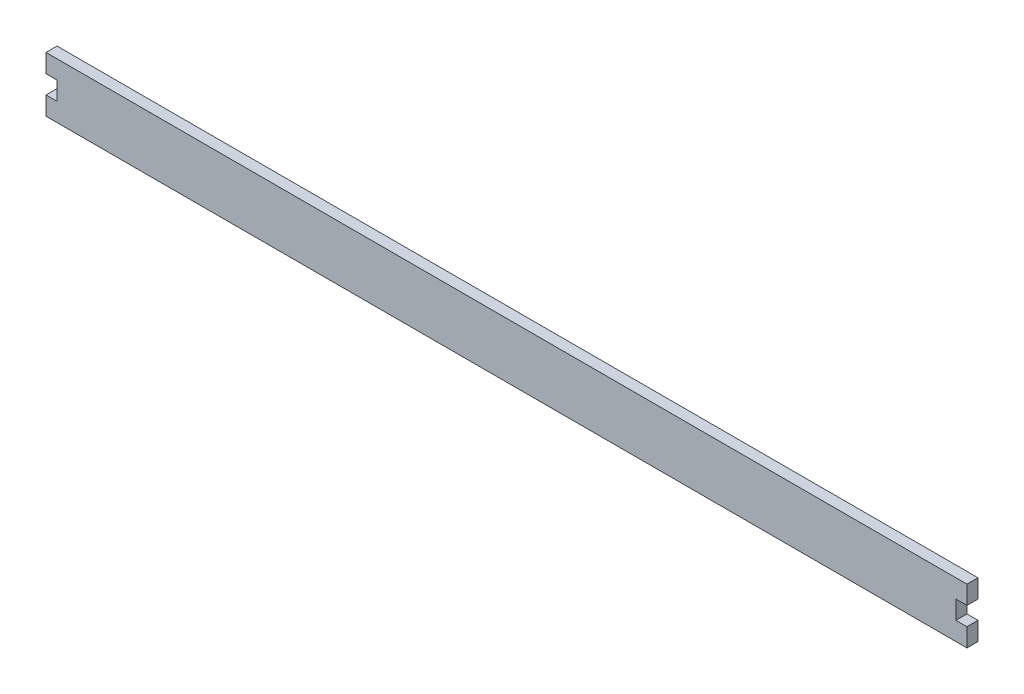
ISO-10303-21;
HEADER;
FILE_DESCRIPTION(('STEP AP214'),'2;1');
FILE_NAME('part.step','',(''),(''),'','','');
FILE_SCHEMA(('AUTOMOTIVE_DESIGN { 1 0 10303 214 1 1 1 1 }'));
ENDSEC;
DATA;
#1=APPLICATION_CONTEXT('core data for automotive mechanical design processes');
#2=APPLICATION_PROTOCOL_DEFINITION('international standard','automotive_design',2000,#1);
#3=PRODUCT_CONTEXT('',#1,'mechanical');
#4=PRODUCT('Part','Part','',(#3));
#5=PRODUCT_RELATED_PRODUCT_CATEGORY('part','',(#4));
#6=PRODUCT_DEFINITION_FORMATION('','',#4);
#7=PRODUCT_DEFINITION_CONTEXT('part definition',#1,'design');
#8=PRODUCT_DEFINITION('design','',#6,#7);
#9=PRODUCT_DEFINITION_SHAPE('','',#8);
#10=(LENGTH_UNIT() NAMED_UNIT(*) SI_UNIT(.MILLI.,.METRE.));
#11=(NAMED_UNIT(*) PLANE_ANGLE_UNIT() SI_UNIT($,.RADIAN.));
#12=(NAMED_UNIT(*) SI_UNIT($,.STERADIAN.) SOLID_ANGLE_UNIT());
#13=UNCERTAINTY_MEASURE_WITH_UNIT(LENGTH_MEASURE(1.E-05),#10,'distance_accuracy_value','');
#14=(GEOMETRIC_REPRESENTATION_CONTEXT(3) GLOBAL_UNCERTAINTY_ASSIGNED_CONTEXT((#13)) GLOBAL_UNIT_ASSIGNED_CONTEXT((#10,
#11,#12)) REPRESENTATION_CONTEXT('',''));
#15=CARTESIAN_POINT('',(0.,0.,0.));
#16=DIRECTION('',(0.,0.,1.));
#17=DIRECTION('',(1.,0.,0.));
#18=AXIS2_PLACEMENT_3D('',#15,#16,#17);
#19=CARTESIAN_POINT('',(-65.2047278841298,0.,6.));
#20=DIRECTION('',(1.,0.,0.));
#21=DIRECTION('',(0.,0.,-1.));
#22=AXIS2_PLACEMENT_3D('',#19,#20,#21);
#23=PLANE('',#22);
#24=DIRECTION('',(0.,-1.,0.));
#25=VECTOR('',#24,1.);
#26=CARTESIAN_POINT('',(-65.2047278841298,0.,0.));
#27=LINE('',#26,#25);
#28=CARTESIAN_POINT('',(-65.2047278841298,13.5511354420113,0.));
#29=VERTEX_POINT('',#28);
#30=CARTESIAN_POINT('',(-65.2047278841298,3.55113544201134,0.));
#31=VERTEX_POINT('',#30);
#32=EDGE_CURVE('E159',#29,#31,#27,.T.);
#33=ORIENTED_EDGE('',*,*,#32,.T.);
#34=DIRECTION('',(0.,0.,-1.));
#35=VECTOR('',#34,1.);
#36=CARTESIAN_POINT('',(-65.2047278841298,3.55113544201134,6.));
#37=LINE('',#36,#35);
#38=CARTESIAN_POINT('',(-65.2047278841298,3.55113544201134,6.));
#39=VERTEX_POINT('',#38);
#40=EDGE_CURVE('E11',#39,#31,#37,.T.);
#41=ORIENTED_EDGE('',*,*,#40,.F.);
#42=DIRECTION('',(0.,-1.,0.));
#43=VECTOR('',#42,1.);
#44=CARTESIAN_POINT('',(-65.2047278841298,0.,6.));
#45=LINE('',#44,#43);
#46=CARTESIAN_POINT('',(-65.2047278841298,13.5511354420113,6.));
#47=VERTEX_POINT('',#46);
#48=EDGE_CURVE('E183',#47,#39,#45,.T.);
#49=ORIENTED_EDGE('',*,*,#48,.F.);
#50=DIRECTION('',(0.,0.,-1.));
#51=VECTOR('',#50,1.);
#52=CARTESIAN_POINT('',(-65.2047278841298,13.5511354420113,6.));
#53=LINE('',#52,#51);
#54=EDGE_CURVE('E158',#47,#29,#53,.T.);
#55=ORIENTED_EDGE('',*,*,#54,.T.);
#56=EDGE_LOOP('',(#33,#41,#49,#55));
#57=FACE_BOUND('',#56,.T.);
#58=ADVANCED_FACE('F34',(#57),#23,.F.);
#59=CARTESIAN_POINT('',(0.,3.55113544201135,6.));
#60=DIRECTION('',(0.,-1.,0.));
#61=DIRECTION('',(1.,0.,0.));
#62=AXIS2_PLACEMENT_3D('',#59,#60,#61);
#63=PLANE('',#62);
#64=DIRECTION('',(-1.,0.,0.));
#65=VECTOR('',#64,1.);
#66=CARTESIAN_POINT('',(0.,3.55113544201135,0.));
#67=LINE('',#66,#65);
#68=CARTESIAN_POINT('',(-71.2047278841298,3.55113544201134,0.));
#69=VERTEX_POINT('',#68);
#70=EDGE_CURVE('E162',#31,#69,#67,.T.);
#71=ORIENTED_EDGE('',*,*,#70,.T.);
#72=DIRECTION('',(0.,0.,-1.));
#73=VECTOR('',#72,1.);
#74=CARTESIAN_POINT('',(-71.2047278841298,3.55113544201134,6.));
#75=LINE('',#74,#73);
#76=CARTESIAN_POINT('',(-71.2047278841298,3.55113544201134,6.));
#77=VERTEX_POINT('',#76);
#78=EDGE_CURVE('E42',#77,#69,#75,.T.);
#79=ORIENTED_EDGE('',*,*,#78,.F.);
#80=DIRECTION('',(-1.,0.,0.));
#81=VECTOR('',#80,1.);
#82=CARTESIAN_POINT('',(0.,3.55113544201135,6.));
#83=LINE('',#82,#81);
#84=EDGE_CURVE('E104',#39,#77,#83,.T.);
#85=ORIENTED_EDGE('',*,*,#84,.F.);
#86=ORIENTED_EDGE('',*,*,#40,.T.);
#87=EDGE_LOOP('',(#71,#79,#85,#86));
#88=FACE_BOUND('',#87,.T.);
#89=ADVANCED_FACE('F252',(#88),#63,.F.);
#90=CARTESIAN_POINT('',(-71.2047278841298,0.,6.));
#91=DIRECTION('',(1.,0.,0.));
#92=DIRECTION('',(0.,0.,-1.));
#93=AXIS2_PLACEMENT_3D('',#90,#91,#92);
#94=PLANE('',#93);
#95=DIRECTION('',(0.,-1.,0.));
#96=VECTOR('',#95,1.);
#97=CARTESIAN_POINT('',(-71.2047278841298,0.,0.));
#98=LINE('',#97,#96);
#99=CARTESIAN_POINT('',(-71.2047278841298,-6.44886455798865,0.));
#100=VERTEX_POINT('',#99);
#101=EDGE_CURVE('E164',#69,#100,#98,.T.);
#102=ORIENTED_EDGE('',*,*,#101,.T.);
#103=DIRECTION('',(0.,0.,-1.));
#104=VECTOR('',#103,1.);
#105=CARTESIAN_POINT('',(-71.2047278841298,-6.44886455798865,6.));
#106=LINE('',#105,#104);
#107=CARTESIAN_POINT('',(-71.2047278841298,-6.44886455798865,6.));
#108=VERTEX_POINT('',#107);
#109=EDGE_CURVE('E198',#108,#100,#106,.T.);
#110=ORIENTED_EDGE('',*,*,#109,.F.);
#111=DIRECTION('',(0.,-1.,0.));
#112=VECTOR('',#111,1.);
#113=CARTESIAN_POINT('',(-71.2047278841298,0.,6.));
#114=LINE('',#113,#112);
#115=EDGE_CURVE('E144',#77,#108,#114,.T.);
#116=ORIENTED_EDGE('',*,*,#115,.F.);
#117=ORIENTED_EDGE('',*,*,#78,.T.);
#118=EDGE_LOOP('',(#102,#110,#116,#117));
#119=FACE_BOUND('',#118,.T.);
#120=ADVANCED_FACE('F204',(#119),#94,.F.);
#121=CARTESIAN_POINT('',(0.,-6.44886455798865,6.));
#122=DIRECTION('',(0.,1.,0.));
#123=DIRECTION('',(0.,0.,1.));
#124=AXIS2_PLACEMENT_3D('',#121,#122,#123);
#125=PLANE('',#124);
#126=DIRECTION('',(1.,0.,0.));
#127=VECTOR('',#126,1.);
#128=CARTESIAN_POINT('',(0.,-6.44886455798865,0.));
#129=LINE('',#128,#127);
#130=CARTESIAN_POINT('',(428.79527211587,-6.44886455798865,0.));
#131=VERTEX_POINT('',#130);
#132=EDGE_CURVE('E166',#100,#131,#129,.T.);
#133=ORIENTED_EDGE('',*,*,#132,.T.);
#134=DIRECTION('',(0.,0.,-1.));
#135=VECTOR('',#134,1.);
#136=CARTESIAN_POINT('',(428.79527211587,-6.44886455798865,6.));
#137=LINE('',#136,#135);
#138=CARTESIAN_POINT('',(428.79527211587,-6.44886455798865,6.));
#139=VERTEX_POINT('',#138);
#140=EDGE_CURVE('E195',#139,#131,#137,.T.);
#141=ORIENTED_EDGE('',*,*,#140,.F.);
#142=DIRECTION('',(1.,0.,0.));
#143=VECTOR('',#142,1.);
#144=CARTESIAN_POINT('',(0.,-6.44886455798865,6.));
#145=LINE('',#144,#143);
#146=EDGE_CURVE('E222',#108,#139,#145,.T.);
#147=ORIENTED_EDGE('',*,*,#146,.F.);
#148=ORIENTED_EDGE('',*,*,#109,.T.);
#149=EDGE_LOOP('',(#133,#141,#147,#148));
#150=FACE_BOUND('',#149,.T.);
#151=ADVANCED_FACE('F213',(#150),#125,.F.);
#152=CARTESIAN_POINT('',(428.79527211587,0.,6.));
#153=DIRECTION('',(-1.,0.,0.));
#154=DIRECTION('',(0.,0.,1.));
#155=AXIS2_PLACEMENT_3D('',#152,#153,#154);
#156=PLANE('',#155);
#157=DIRECTION('',(0.,1.,0.));
#158=VECTOR('',#157,1.);
#159=CARTESIAN_POINT('',(428.79527211587,0.,0.));
#160=LINE('',#159,#158);
#161=CARTESIAN_POINT('',(428.79527211587,3.55113544201134,0.));
#162=VERTEX_POINT('',#161);
#163=EDGE_CURVE('E168',#131,#162,#160,.T.);
#164=ORIENTED_EDGE('',*,*,#163,.T.);
#165=DIRECTION('',(0.,0.,-1.));
#166=VECTOR('',#165,1.);
#167=CARTESIAN_POINT('',(428.79527211587,3.55113544201134,6.));
#168=LINE('',#167,#166);
#169=CARTESIAN_POINT('',(428.79527211587,3.55113544201134,6.));
#170=VERTEX_POINT('',#169);
#171=EDGE_CURVE('E193',#170,#162,#168,.T.);
#172=ORIENTED_EDGE('',*,*,#171,.F.);
#173=DIRECTION('',(0.,1.,0.));
#174=VECTOR('',#173,1.);
#175=CARTESIAN_POINT('',(428.79527211587,0.,6.));
#176=LINE('',#175,#174);
#177=EDGE_CURVE('E153',#139,#170,#176,.T.);
#178=ORIENTED_EDGE('',*,*,#177,.F.);
#179=ORIENTED_EDGE('',*,*,#140,.T.);
#180=EDGE_LOOP('',(#164,#172,#178,#179));
#181=FACE_BOUND('',#180,.T.);
#182=ADVANCED_FACE('F217',(#181),#156,.F.);
#183=CARTESIAN_POINT('',(0.,3.55113544201134,6.));
#184=DIRECTION('',(0.,1.,0.));
#185=DIRECTION('',(0.,0.,1.));
#186=AXIS2_PLACEMENT_3D('',#183,#184,#185);
#187=PLANE('',#186);
#188=DIRECTION('',(1.,0.,0.));
#189=VECTOR('',#188,1.);
#190=CARTESIAN_POINT('',(0.,3.55113544201134,0.));
#191=LINE('',#190,#189);
#192=CARTESIAN_POINT('',(422.79527211587,3.55113544201134,0.));
#193=VERTEX_POINT('',#192);
#194=EDGE_CURVE('E171',#193,#162,#191,.T.);
#195=ORIENTED_EDGE('',*,*,#194,.F.);
#196=DIRECTION('',(0.,0.,-1.));
#197=VECTOR('',#196,1.);
#198=CARTESIAN_POINT('',(422.79527211587,3.55113544201134,6.));
#199=LINE('',#198,#197);
#200=CARTESIAN_POINT('',(422.79527211587,3.55113544201134,6.));
#201=VERTEX_POINT('',#200);
#202=EDGE_CURVE('E191',#201,#193,#199,.T.);
#203=ORIENTED_EDGE('',*,*,#202,.F.);
#204=DIRECTION('',(1.,0.,0.));
#205=VECTOR('',#204,1.);
#206=CARTESIAN_POINT('',(0.,3.55113544201134,6.));
#207=LINE('',#206,#205);
#208=EDGE_CURVE('E221',#201,#170,#207,.T.);
#209=ORIENTED_EDGE('',*,*,#208,.T.);
#210=ORIENTED_EDGE('',*,*,#171,.T.);
#211=EDGE_LOOP('',(#195,#203,#209,#210));
#212=FACE_BOUND('',#211,.T.);
#213=ADVANCED_FACE('F236',(#212),#187,.T.);
#214=CARTESIAN_POINT('',(422.79527211587,0.,6.));
#215=DIRECTION('',(1.,0.,0.));
#216=DIRECTION('',(0.,0.,-1.));
#217=AXIS2_PLACEMENT_3D('',#214,#215,#216);
#218=PLANE('',#217);
#219=DIRECTION('',(0.,-1.,0.));
#220=VECTOR('',#219,1.);
#221=CARTESIAN_POINT('',(422.79527211587,0.,0.));
#222=LINE('',#221,#220);
#223=CARTESIAN_POINT('',(422.79527211587,13.5511354420113,0.));
#224=VERTEX_POINT('',#223);
#225=EDGE_CURVE('E175',#224,#193,#222,.T.);
#226=ORIENTED_EDGE('',*,*,#225,.F.);
#227=DIRECTION('',(0.,0.,-1.));
#228=VECTOR('',#227,1.);
#229=CARTESIAN_POINT('',(422.79527211587,13.5511354420113,6.));
#230=LINE('',#229,#228);
#231=CARTESIAN_POINT('',(422.79527211587,13.5511354420113,6.));
#232=VERTEX_POINT('',#231);
#233=EDGE_CURVE('E189',#232,#224,#230,.T.);
#234=ORIENTED_EDGE('',*,*,#233,.F.);
#235=DIRECTION('',(0.,-1.,0.));
#236=VECTOR('',#235,1.);
#237=CARTESIAN_POINT('',(422.79527211587,0.,6.));
#238=LINE('',#237,#236);
#239=EDGE_CURVE('E223',#232,#201,#238,.T.);
#240=ORIENTED_EDGE('',*,*,#239,.T.);
#241=ORIENTED_EDGE('',*,*,#202,.T.);
#242=EDGE_LOOP('',(#226,#234,#240,#241));
#243=FACE_BOUND('',#242,.T.);
#244=ADVANCED_FACE('F237',(#243),#218,.T.);
#245=CARTESIAN_POINT('',(0.,13.5511354420113,6.));
#246=DIRECTION('',(0.,-1.,0.));
#247=DIRECTION('',(0.,0.,-1.));
#248=AXIS2_PLACEMENT_3D('',#245,#246,#247);
#249=PLANE('',#248);
#250=DIRECTION('',(-1.,0.,0.));
#251=VECTOR('',#250,1.);
#252=CARTESIAN_POINT('',(0.,13.5511354420113,0.));
#253=LINE('',#252,#251);
#254=CARTESIAN_POINT('',(428.79527211587,13.5511354420113,0.));
#255=VERTEX_POINT('',#254);
#256=EDGE_CURVE('E178',#255,#224,#253,.T.);
#257=ORIENTED_EDGE('',*,*,#256,.F.);
#258=DIRECTION('',(0.,0.,-1.));
#259=VECTOR('',#258,1.);
#260=CARTESIAN_POINT('',(428.79527211587,13.5511354420113,6.));
#261=LINE('',#260,#259);
#262=CARTESIAN_POINT('',(428.79527211587,13.5511354420113,6.));
#263=VERTEX_POINT('',#262);
#264=EDGE_CURVE('E187',#263,#255,#261,.T.);
#265=ORIENTED_EDGE('',*,*,#264,.F.);
#266=DIRECTION('',(-1.,0.,0.));
#267=VECTOR('',#266,1.);
#268=CARTESIAN_POINT('',(0.,13.5511354420113,6.));
#269=LINE('',#268,#267);
#270=EDGE_CURVE('E151',#263,#232,#269,.T.);
#271=ORIENTED_EDGE('',*,*,#270,.T.);
#272=ORIENTED_EDGE('',*,*,#233,.T.);
#273=EDGE_LOOP('',(#257,#265,#271,#272));
#274=FACE_BOUND('',#273,.T.);
#275=ADVANCED_FACE('F232',(#274),#249,.T.);
#276=CARTESIAN_POINT('',(428.79527211587,23.5511354420113,0.));
#277=VERTEX_POINT('',#276);
#278=EDGE_CURVE('E172',#255,#277,#160,.T.);
#279=ORIENTED_EDGE('',*,*,#278,.T.);
#280=DIRECTION('',(0.,0.,-1.));
#281=VECTOR('',#280,1.);
#282=CARTESIAN_POINT('',(428.79527211587,23.5511354420113,6.));
#283=LINE('',#282,#281);
#284=CARTESIAN_POINT('',(428.79527211587,23.5511354420113,6.));
#285=VERTEX_POINT('',#284);
#286=EDGE_CURVE('E138',#285,#277,#283,.T.);
#287=ORIENTED_EDGE('',*,*,#286,.F.);
#288=EDGE_CURVE('E148',#263,#285,#176,.T.);
#289=ORIENTED_EDGE('',*,*,#288,.F.);
#290=ORIENTED_EDGE('',*,*,#264,.T.);
#291=EDGE_LOOP('',(#279,#287,#289,#290));
#292=FACE_BOUND('',#291,.T.);
#293=ADVANCED_FACE('F241',(#292),#156,.F.);
#294=CARTESIAN_POINT('',(0.,23.5511354420113,6.));
#295=DIRECTION('',(0.,1.,0.));
#296=DIRECTION('',(0.,0.,1.));
#297=AXIS2_PLACEMENT_3D('',#294,#295,#296);
#298=PLANE('',#297);
#299=DIRECTION('',(1.,0.,0.));
#300=VECTOR('',#299,1.);
#301=CARTESIAN_POINT('',(0.,23.5511354420113,0.));
#302=LINE('',#301,#300);
#303=CARTESIAN_POINT('',(-71.2047278841298,23.5511354420113,0.));
#304=VERTEX_POINT('',#303);
#305=EDGE_CURVE('E137',#304,#277,#302,.T.);
#306=ORIENTED_EDGE('',*,*,#305,.F.);
#307=DIRECTION('',(0.,0.,-1.));
#308=VECTOR('',#307,1.);
#309=CARTESIAN_POINT('',(-71.2047278841298,23.5511354420113,6.));
#310=LINE('',#309,#308);
#311=CARTESIAN_POINT('',(-71.2047278841298,23.5511354420113,6.));
#312=VERTEX_POINT('',#311);
#313=EDGE_CURVE('E131',#312,#304,#310,.T.);
#314=ORIENTED_EDGE('',*,*,#313,.F.);
#315=DIRECTION('',(1.,0.,0.));
#316=VECTOR('',#315,1.);
#317=CARTESIAN_POINT('',(0.,23.5511354420113,6.));
#318=LINE('',#317,#316);
#319=EDGE_CURVE('E135',#312,#285,#318,.T.);
#320=ORIENTED_EDGE('',*,*,#319,.T.);
#321=ORIENTED_EDGE('',*,*,#286,.T.);
#322=EDGE_LOOP('',(#306,#314,#320,#321));
#323=FACE_BOUND('',#322,.T.);
#324=ADVANCED_FACE('F133',(#323),#298,.T.);
#325=CARTESIAN_POINT('',(-71.2047278841298,13.5511354420113,0.));
#326=VERTEX_POINT('',#325);
#327=EDGE_CURVE('E90',#304,#326,#98,.T.);
#328=ORIENTED_EDGE('',*,*,#327,.T.);
#329=DIRECTION('',(0.,0.,-1.));
#330=VECTOR('',#329,1.);
#331=CARTESIAN_POINT('',(-71.2047278841298,13.5511354420113,6.));
#332=LINE('',#331,#330);
#333=CARTESIAN_POINT('',(-71.2047278841298,13.5511354420113,6.));
#334=VERTEX_POINT('',#333);
#335=EDGE_CURVE('E139',#334,#326,#332,.T.);
#336=ORIENTED_EDGE('',*,*,#335,.F.);
#337=EDGE_CURVE('E141',#312,#334,#114,.T.);
#338=ORIENTED_EDGE('',*,*,#337,.F.);
#339=ORIENTED_EDGE('',*,*,#313,.T.);
#340=EDGE_LOOP('',(#328,#336,#338,#339));
#341=FACE_BOUND('',#340,.T.);
#342=ADVANCED_FACE('F142',(#341),#94,.F.);
#343=CARTESIAN_POINT('',(0.,13.5511354420113,6.));
#344=DIRECTION('',(0.,1.,0.));
#345=DIRECTION('',(0.,0.,1.));
#346=AXIS2_PLACEMENT_3D('',#343,#344,#345);
#347=PLANE('',#346);
#348=DIRECTION('',(1.,0.,0.));
#349=VECTOR('',#348,1.);
#350=CARTESIAN_POINT('',(0.,13.5511354420113,0.));
#351=LINE('',#350,#349);
#352=EDGE_CURVE('E96',#326,#29,#351,.T.);
#353=ORIENTED_EDGE('',*,*,#352,.T.);
#354=ORIENTED_EDGE('',*,*,#54,.F.);
#355=DIRECTION('',(1.,0.,0.));
#356=VECTOR('',#355,1.);
#357=CARTESIAN_POINT('',(0.,13.5511354420113,6.));
#358=LINE('',#357,#356);
#359=EDGE_CURVE('E50',#334,#47,#358,.T.);
#360=ORIENTED_EDGE('',*,*,#359,.F.);
#361=ORIENTED_EDGE('',*,*,#335,.T.);
#362=EDGE_LOOP('',(#353,#354,#360,#361));
#363=FACE_BOUND('',#362,.T.);
#364=ADVANCED_FACE('F259',(#363),#347,.F.);
#365=CARTESIAN_POINT('',(0.,0.,6.));
#366=DIRECTION('',(0.,0.,1.));
#367=DIRECTION('',(1.,0.,0.));
#368=AXIS2_PLACEMENT_3D('',#365,#366,#367);
#369=PLANE('',#368);
#370=ORIENTED_EDGE('',*,*,#48,.T.);
#371=ORIENTED_EDGE('',*,*,#84,.T.);
#372=ORIENTED_EDGE('',*,*,#115,.T.);
#373=ORIENTED_EDGE('',*,*,#146,.T.);
#374=ORIENTED_EDGE('',*,*,#177,.T.);
#375=ORIENTED_EDGE('',*,*,#208,.F.);
#376=ORIENTED_EDGE('',*,*,#239,.F.);
#377=ORIENTED_EDGE('',*,*,#270,.F.);
#378=ORIENTED_EDGE('',*,*,#288,.T.);
#379=ORIENTED_EDGE('',*,*,#319,.F.);
#380=ORIENTED_EDGE('',*,*,#337,.T.);
#381=ORIENTED_EDGE('',*,*,#359,.T.);
#382=EDGE_LOOP('',(#370,#371,#372,#373,#374,#375,#376,#377,#378,#379,#380,#381));
#383=FACE_BOUND('',#382,.T.);
#384=ADVANCED_FACE('F145',(#383),#369,.T.);
#385=CARTESIAN_POINT('',(0.,0.,0.));
#386=DIRECTION('',(0.,0.,1.));
#387=DIRECTION('',(1.,0.,0.));
#388=AXIS2_PLACEMENT_3D('',#385,#386,#387);
#389=PLANE('',#388);
#390=ORIENTED_EDGE('',*,*,#32,.F.);
#391=ORIENTED_EDGE('',*,*,#352,.F.);
#392=ORIENTED_EDGE('',*,*,#327,.F.);
#393=ORIENTED_EDGE('',*,*,#305,.T.);
#394=ORIENTED_EDGE('',*,*,#278,.F.);
#395=ORIENTED_EDGE('',*,*,#256,.T.);
#396=ORIENTED_EDGE('',*,*,#225,.T.);
#397=ORIENTED_EDGE('',*,*,#194,.T.);
#398=ORIENTED_EDGE('',*,*,#163,.F.);
#399=ORIENTED_EDGE('',*,*,#132,.F.);
#400=ORIENTED_EDGE('',*,*,#101,.F.);
#401=ORIENTED_EDGE('',*,*,#70,.F.);
#402=EDGE_LOOP('',(#390,#391,#392,#393,#394,#395,#396,#397,#398,#399,#400,#401));
#403=FACE_BOUND('',#402,.T.);
#404=ADVANCED_FACE('F209',(#403),#389,.F.);
#405=CLOSED_SHELL('',(#58,#89,#120,#151,#182,#213,#244,#275,#293,#324,#342,#364,#384,#404));
#406=MANIFOLD_SOLID_BREP('B2',#405);
#407=ADVANCED_BREP_SHAPE_REPRESENTATION('',(#18,#406),#14);
#408=SHAPE_DEFINITION_REPRESENTATION(#9,#407);
ENDSEC;
END-ISO-10303-21;
